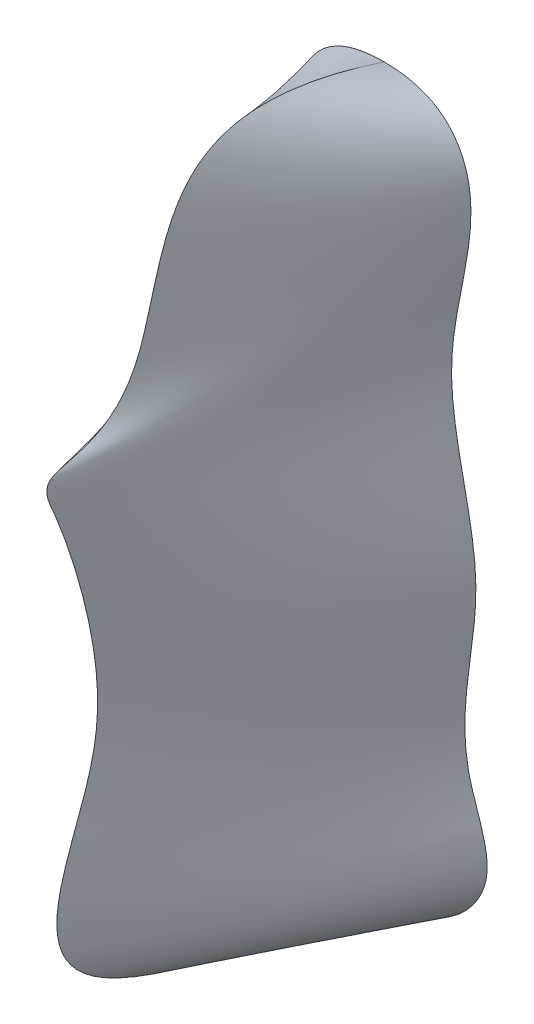
ISO-10303-21;
HEADER;
FILE_DESCRIPTION(('STEP AP214'),'2;1');
FILE_NAME('part.step','',(''),(''),'','','');
FILE_SCHEMA(('AUTOMOTIVE_DESIGN { 1 0 10303 214 1 1 1 1 }'));
ENDSEC;
DATA;
#1=APPLICATION_CONTEXT('core data for automotive mechanical design processes');
#2=APPLICATION_PROTOCOL_DEFINITION('international standard','automotive_design',2000,#1);
#3=PRODUCT_CONTEXT('',#1,'mechanical');
#4=PRODUCT('Part','Part','',(#3));
#5=PRODUCT_RELATED_PRODUCT_CATEGORY('part','',(#4));
#6=PRODUCT_DEFINITION_FORMATION('','',#4);
#7=PRODUCT_DEFINITION_CONTEXT('part definition',#1,'design');
#8=PRODUCT_DEFINITION('design','',#6,#7);
#9=PRODUCT_DEFINITION_SHAPE('','',#8);
#10=(LENGTH_UNIT() NAMED_UNIT(*) SI_UNIT(.MILLI.,.METRE.));
#11=(NAMED_UNIT(*) PLANE_ANGLE_UNIT() SI_UNIT($,.RADIAN.));
#12=(NAMED_UNIT(*) SI_UNIT($,.STERADIAN.) SOLID_ANGLE_UNIT());
#13=UNCERTAINTY_MEASURE_WITH_UNIT(LENGTH_MEASURE(1.E-05),#10,'distance_accuracy_value','');
#14=(GEOMETRIC_REPRESENTATION_CONTEXT(3) GLOBAL_UNCERTAINTY_ASSIGNED_CONTEXT((#13)) GLOBAL_UNIT_ASSIGNED_CONTEXT((#10,
#11,#12)) REPRESENTATION_CONTEXT('',''));
#15=CARTESIAN_POINT('',(0.,0.,0.));
#16=DIRECTION('',(0.,0.,1.));
#17=DIRECTION('',(1.,0.,0.));
#18=AXIS2_PLACEMENT_3D('',#15,#16,#17);
#19=CARTESIAN_POINT('',(0.,0.,0.));
#20=DIRECTION('',(0.,0.,1.));
#21=DIRECTION('',(1.,0.,0.));
#22=AXIS2_PLACEMENT_3D('',#19,#20,#21);
#23=PLANE('',#22);
#24=CARTESIAN_POINT('',(0.,-119.129235642163,0.));
#25=CARTESIAN_POINT('',(-5.48399979645558,-119.129235642163,0.));
#26=CARTESIAN_POINT('',(-13.8478622037575,-116.927261861599,0.));
#27=CARTESIAN_POINT('',(-22.1772053974844,-109.959351759126,0.));
#28=CARTESIAN_POINT('',(-25.5032366973788,-104.215245078503,0.));
#29=CARTESIAN_POINT('',(-26.3903750569086,-99.6534242154083,0.));
#30=CARTESIAN_POINT('',(-26.2585480775786,-95.8638796795702,0.));
#31=CARTESIAN_POINT('',(-25.1570675054309,-90.8407806983924,0.));
#32=CARTESIAN_POINT('',(-23.3507093255081,-85.9033015284378,0.));
#33=CARTESIAN_POINT('',(-22.2723368230284,-82.3617609658537,0.));
#34=CARTESIAN_POINT('',(-21.9316080637026,-81.0803199413565,0.));
#35=CARTESIAN_POINT('',(-21.2966625685179,-78.5825608715299,0.));
#36=CARTESIAN_POINT('',(-20.4244703114295,-72.6717924955169,0.));
#37=CARTESIAN_POINT('',(-20.6410560037412,-66.4789326386389,0.));
#38=CARTESIAN_POINT('',(-21.4728669454895,-57.5706817754429,0.));
#39=CARTESIAN_POINT('',(-22.3974310883937,-51.9503014310119,0.));
#40=CARTESIAN_POINT('',(-22.9458516318404,-46.7872022990454,0.));
#41=CARTESIAN_POINT('',(-23.1487004428223,-44.8495205048332,0.));
#42=CARTESIAN_POINT('',(-23.523959037703,-40.4426150918797,0.));
#43=CARTESIAN_POINT('',(-23.3843523134783,-33.9956772951204,0.));
#44=CARTESIAN_POINT('',(-22.0629202569013,-23.5681445082839,0.));
#45=CARTESIAN_POINT('',(-19.567261691251,-13.0780107241993,0.));
#46=CARTESIAN_POINT('',(-17.9449621263461,-3.56691671409386,0.));
#47=CARTESIAN_POINT('',(-17.372180178593,1.86551288266947,0.));
#48=CARTESIAN_POINT('',(-17.2066029441435,4.97504273164082,0.));
#49=CARTESIAN_POINT('',(-17.2309613773402,8.6765108243899,0.));
#50=CARTESIAN_POINT('',(-17.3761300157578,11.1771831859446,0.));
#51=CARTESIAN_POINT('',(-17.5810395114394,13.1536789923446,0.));
#52=CARTESIAN_POINT('',(-18.2630607748619,19.0872908589465,0.));
#53=CARTESIAN_POINT('',(-20.0706882981899,27.3589184416595,0.));
#54=CARTESIAN_POINT('',(-21.7265724819304,36.8893644465746,0.));
#55=CARTESIAN_POINT('',(-22.1166823619826,41.6254763822693,0.));
#56=CARTESIAN_POINT('',(-22.2307777149192,45.7834084200696,0.));
#57=CARTESIAN_POINT('',(-21.935413160548,49.6011848804442,0.));
#58=CARTESIAN_POINT('',(-20.7900504282564,53.7458860061697,0.));
#59=CARTESIAN_POINT('',(-19.2538935127385,57.411107423138,0.));
#60=CARTESIAN_POINT('',(-16.7723620438494,60.7450652821421,0.));
#61=CARTESIAN_POINT('',(-12.9724574464762,63.630905841916,0.));
#62=CARTESIAN_POINT('',(-7.73988467458753,65.9658932005866,0.));
#63=CARTESIAN_POINT('',(-3.00582987240848,66.4763446761754,0.));
#64=CARTESIAN_POINT('',(0.,66.4763446761754,0.));
#65=B_SPLINE_CURVE_WITH_KNOTS('',3,(#24,#25,#26,#27,#28,#29,#30,#31,#32,#33,#34,#35,#36,#37,#38,
#39,#40,#41,#42,#43,#44,#45,#46,#47,#48,#49,#50,#51,#52,#53,#54,#55,#56,#57,#58,#59,#60,#61,#62,
#63,#64),.UNSPECIFIED.,.F.,.F.,(4,1,1,1,1,1,1,1,2,1,1,1,1,1,2,1,1,1,1,1,1,1,1,1,2,1,1,1,1,1,1,1,
1,1,1,4),(0.,0.0757535775039592,0.115124491824758,0.147926686342702,0.165899705909486,
0.178786214817512,0.200138898595952,0.236696235595362,0.251306105832758,0.255014075804887,
0.286912248987947,0.33357501469864,0.34044396366016,0.410374639338128,0.412174808925913,
0.437290124185794,0.473231144814136,0.501100005431592,0.582382975594219,0.622037419765252,
0.634266738064513,0.657878408307154,0.665013128791956,0.68541085006515,0.692462696595046,
0.767929709030146,0.809294645509021,0.826014632497191,0.83353893672674,0.866729597518556,
0.878573801359312,0.89281893485578,0.921534056959989,0.935104871489121,0.958486547415341,1.),.UNSPECIFIED.);
#66=CARTESIAN_POINT('',(0.,66.4763446761752,-3.83726710373055E-13));
#67=VERTEX_POINT('',#66);
#68=CARTESIAN_POINT('',(0.,-119.129235642163,0.));
#69=VERTEX_POINT('',#68);
#70=EDGE_CURVE('E86',#67,#69,#65,.F.);
#71=ORIENTED_EDGE('',*,*,#70,.F.);
#72=CARTESIAN_POINT('',(0.,-119.129235642163,0.));
#73=CARTESIAN_POINT('',(5.48399979645558,-119.129235642163,0.));
#74=CARTESIAN_POINT('',(13.8478622037575,-116.927261861599,0.));
#75=CARTESIAN_POINT('',(22.1772053974843,-109.959351759126,0.));
#76=CARTESIAN_POINT('',(25.5032366973789,-104.215245078503,0.));
#77=CARTESIAN_POINT('',(26.3903750569087,-99.6534242154083,0.));
#78=CARTESIAN_POINT('',(26.2585480775786,-95.8638796795701,0.));
#79=CARTESIAN_POINT('',(25.157067505431,-90.8407806983927,0.));
#80=CARTESIAN_POINT('',(23.350709325508,-85.9033015284386,0.));
#81=CARTESIAN_POINT('',(22.2723368230284,-82.361760965854,0.));
#82=CARTESIAN_POINT('',(21.9316080637026,-81.0803199413565,0.));
#83=CARTESIAN_POINT('',(21.296662568518,-78.5825608715295,0.));
#84=CARTESIAN_POINT('',(20.4244703114296,-72.6717924955173,0.));
#85=CARTESIAN_POINT('',(20.6410560037411,-66.4789326386392,0.));
#86=CARTESIAN_POINT('',(21.4728669454895,-57.5706817754429,0.));
#87=CARTESIAN_POINT('',(22.3974310883937,-51.9503014310117,0.));
#88=CARTESIAN_POINT('',(22.9458516318404,-46.7872022990453,0.));
#89=CARTESIAN_POINT('',(23.1487004428223,-44.8495205048331,0.));
#90=CARTESIAN_POINT('',(23.523959037703,-40.4426150918797,0.));
#91=CARTESIAN_POINT('',(23.3843523134783,-33.9956772951204,0.));
#92=CARTESIAN_POINT('',(22.0629202569013,-23.5681445082838,0.));
#93=CARTESIAN_POINT('',(19.5672616912507,-13.0780107241991,0.));
#94=CARTESIAN_POINT('',(17.944962126346,-3.56691671409373,0.));
#95=CARTESIAN_POINT('',(17.3721801785931,1.86551288266953,0.));
#96=CARTESIAN_POINT('',(17.2066029441435,4.97504273164088,0.));
#97=CARTESIAN_POINT('',(17.2309613773402,8.67651082438992,0.));
#98=CARTESIAN_POINT('',(17.3761300157577,11.1771831859446,0.));
#99=CARTESIAN_POINT('',(17.5810395114394,13.1536789923447,0.));
#100=CARTESIAN_POINT('',(18.2630607748619,19.0872908589466,0.));
#101=CARTESIAN_POINT('',(20.0706882981898,27.3589184416596,0.));
#102=CARTESIAN_POINT('',(21.7265724819305,36.8893644465748,0.));
#103=CARTESIAN_POINT('',(22.1166823619826,41.6254763822692,0.));
#104=CARTESIAN_POINT('',(22.2307777149191,45.7834084200695,0.));
#105=CARTESIAN_POINT('',(21.935413160548,49.6011848804442,0.));
#106=CARTESIAN_POINT('',(20.7900504282564,53.7458860061697,0.));
#107=CARTESIAN_POINT('',(19.2538935127385,57.4111074231379,0.));
#108=CARTESIAN_POINT('',(16.7723620438494,60.7450652821421,0.));
#109=CARTESIAN_POINT('',(12.9724574464762,63.630905841916,0.));
#110=CARTESIAN_POINT('',(7.73988467458753,65.9658932005866,0.));
#111=CARTESIAN_POINT('',(3.00582987240848,66.4763446761754,0.));
#112=CARTESIAN_POINT('',(0.,66.4763446761754,0.));
#113=B_SPLINE_CURVE_WITH_KNOTS('',3,(#72,#73,#74,#75,#76,#77,#78,#79,#80,#81,#82,#83,#84,#85,
#86,#87,#88,#89,#90,#91,#92,#93,#94,#95,#96,#97,#98,#99,#100,#101,#102,#103,#104,#105,#106,#107,
#108,#109,#110,#111,#112),.UNSPECIFIED.,.F.,.F.,(4,1,1,1,1,1,1,1,2,1,1,1,1,1,2,1,1,1,1,1,1,1,1,
1,2,1,1,1,1,1,1,1,1,1,1,4),(0.,0.0757535775039592,0.115124491824758,0.147926686342702,
0.165899705909486,0.178786214817512,0.200138898595952,0.236696235595362,0.251306105832758,
0.255014075804887,0.286912248987947,0.33357501469864,0.34044396366016,0.410374639338128,
0.412174808925913,0.437290124185794,0.473231144814136,0.501100005431592,0.582382975594219,
0.622037419765252,0.634266738064513,0.657878408307154,0.665013128791956,0.68541085006515,
0.692462696595046,0.767929709030146,0.809294645509021,0.826014632497191,0.83353893672674,
0.866729597518556,0.878573801359312,0.89281893485578,0.921534056959989,0.935104871489121,
0.958486547415341,1.),.UNSPECIFIED.);
#114=EDGE_CURVE('E13',#69,#67,#113,.T.);
#115=ORIENTED_EDGE('',*,*,#114,.F.);
#116=EDGE_LOOP('',(#71,#115));
#117=FACE_BOUND('',#116,.T.);
#118=ADVANCED_FACE('F67',(#117),#23,.F.);
#119=CARTESIAN_POINT('',(0.,-119.129235642163,0.));
#120=CARTESIAN_POINT('',(0.,-119.129235642163,0.));
#121=CARTESIAN_POINT('',(0.,-115.684729267578,18.653499300207));
#122=CARTESIAN_POINT('',(-5.48399979645558,-119.129235642163,0.));
#123=CARTESIAN_POINT('',(0.,-111.09722014926,41.7852148196173));
#124=CARTESIAN_POINT('',(-13.8478622037575,-116.927261861599,0.));
#125=CARTESIAN_POINT('',(0.,-104.861834882826,62.2161484048368));
#126=CARTESIAN_POINT('',(-22.1772053974844,-109.959351759126,0.));
#127=CARTESIAN_POINT('',(0.,-100.613229648355,71.2945689341411));
#128=CARTESIAN_POINT('',(-25.5032366973788,-104.215245078503,0.));
#129=CARTESIAN_POINT('',(0.,-97.2579962258294,76.1039582080557));
#130=CARTESIAN_POINT('',(-26.3903750569086,-99.6534242154083,0.));
#131=CARTESIAN_POINT('',(0.,-94.2933052290315,79.2700088025345));
#132=CARTESIAN_POINT('',(-26.2585480775786,-95.8638796795702,0.));
#133=CARTESIAN_POINT('',(0.,-89.914230995515,82.4136260831746));
#134=CARTESIAN_POINT('',(-25.1570675054309,-90.8407806983924,0.));
#135=CARTESIAN_POINT('',(0.,-84.6948198773536,83.704694672683));
#136=CARTESIAN_POINT('',(-23.3507093255081,-85.9033015284378,0.));
#137=CARTESIAN_POINT('',(0.,-80.435747161199,83.4793985463131));
#138=CARTESIAN_POINT('',(-22.2723368230284,-82.3617609658537,0.));
#139=CARTESIAN_POINT('',(0.,-78.8548052590881,83.2854059539554));
#140=CARTESIAN_POINT('',(-21.9316080637026,-81.0803199413565,0.));
#141=CARTESIAN_POINT('',(0.,-75.7540536988175,82.8524111803916));
#142=CARTESIAN_POINT('',(-21.2966625685179,-78.5825608715299,0.));
#143=CARTESIAN_POINT('',(0.,-67.9821779391295,80.6192283715563));
#144=CARTESIAN_POINT('',(-20.4244703114295,-72.6717924955169,0.));
#145=CARTESIAN_POINT('',(0.,-59.6646763353723,77.2442058603551));
#146=CARTESIAN_POINT('',(-20.6410560037412,-66.4789326386389,0.));
#147=CARTESIAN_POINT('',(0.,-49.0503592895246,73.8741721166368));
#148=CARTESIAN_POINT('',(-21.4728669454895,-57.5706817754429,0.));
#149=CARTESIAN_POINT('',(0.,-43.4091086797953,73.0663969821838));
#150=CARTESIAN_POINT('',(-22.3974310883937,-51.9503014310119,0.));
#151=CARTESIAN_POINT('',(0.,-37.7537294011581,73.1293274319195));
#152=CARTESIAN_POINT('',(-22.9458516318404,-46.7872022990454,0.));
#153=CARTESIAN_POINT('',(0.,-35.6270397565945,73.1603831301112));
#154=CARTESIAN_POINT('',(-23.1487004428223,-44.8495205048332,0.));
#155=CARTESIAN_POINT('',(0.,-30.6562886472405,73.4663716847879));
#156=CARTESIAN_POINT('',(-23.523959037703,-40.4426150918797,0.));
#157=CARTESIAN_POINT('',(0.,-23.1286645891634,74.6019580328208));
#158=CARTESIAN_POINT('',(-23.3843523134783,-33.9956772951204,0.));
#159=CARTESIAN_POINT('',(0.,-10.9180065251462,77.27979758046));
#160=CARTESIAN_POINT('',(-22.0629202569013,-23.5681445082839,0.));
#161=CARTESIAN_POINT('',(0.,0.714013766306203,80.9953412643995));
#162=CARTESIAN_POINT('',(-19.567261691251,-13.0780107241993,0.));
#163=CARTESIAN_POINT('',(0.,8.02617014812814,83.89857119465));
#164=CARTESIAN_POINT('',(-17.9449621263461,-3.56691671409386,0.));
#165=CARTESIAN_POINT('',(0.,11.1556070664767,85.2778175725474));
#166=CARTESIAN_POINT('',(-17.372180178593,1.86551288266947,0.));
#167=CARTESIAN_POINT('',(0.,12.6582471725762,85.8609462171586));
#168=CARTESIAN_POINT('',(-17.2066029441435,4.97504273164082,0.));
#169=CARTESIAN_POINT('',(0.,14.3998620359732,86.1571977129723));
#170=CARTESIAN_POINT('',(-17.2309613773402,8.6765108243899,0.));
#171=CARTESIAN_POINT('',(0.,15.5928712678497,86.0816649037519));
#172=CARTESIAN_POINT('',(-17.3761300157578,11.1771831859446,0.));
#173=CARTESIAN_POINT('',(0.,16.2715369348896,85.5715281646994));
#174=CARTESIAN_POINT('',(-17.5810395114394,13.1536789923446,0.));
#175=CARTESIAN_POINT('',(0.,18.1426667496547,83.7180392875684));
#176=CARTESIAN_POINT('',(-18.2630607748619,19.0872908589465,0.));
#177=CARTESIAN_POINT('',(0.,18.2300835563813,76.2465380409917));
#178=CARTESIAN_POINT('',(-20.0706882981899,27.3589184416595,0.));
#179=CARTESIAN_POINT('',(0.,24.7227058163408,67.0939442195577));
#180=CARTESIAN_POINT('',(-21.7265724819304,36.8893644465746,0.));
#181=CARTESIAN_POINT('',(0.,30.9363641447266,63.5146395751189));
#182=CARTESIAN_POINT('',(-22.1166823619826,41.6254763822693,0.));
#183=CARTESIAN_POINT('',(0.,37.6968605332303,60.8738672061137));
#184=CARTESIAN_POINT('',(-22.2307777149192,45.7834084200696,0.));
#185=CARTESIAN_POINT('',(0.,45.4780601721517,59.0007353969081));
#186=CARTESIAN_POINT('',(-21.935413160548,49.6011848804442,0.));
#187=CARTESIAN_POINT('',(0.,53.847061296212,56.3909198600287));
#188=CARTESIAN_POINT('',(-20.7900504282564,53.7458860061697,0.));
#189=CARTESIAN_POINT('',(0.,60.9081003940844,53.4872740191013));
#190=CARTESIAN_POINT('',(-19.2538935127385,57.411107423138,0.));
#191=CARTESIAN_POINT('',(0.,66.7448995063504,49.1995744265794));
#192=CARTESIAN_POINT('',(-16.7723620438494,60.7450652821421,0.));
#193=CARTESIAN_POINT('',(0.,71.1834059991768,41.6834897247874));
#194=CARTESIAN_POINT('',(-12.9724574464762,63.630905841916,0.));
#195=CARTESIAN_POINT('',(0.,73.7025856986463,29.5332596215666));
#196=CARTESIAN_POINT('',(-7.73988467458753,65.9658932005866,0.));
#197=CARTESIAN_POINT('',(0.,70.8929110556788,13.5752804493367));
#198=CARTESIAN_POINT('',(-3.00582987240848,66.4763446761754,0.));
#199=CARTESIAN_POINT('',(0.,66.4763446761751,-7.67453420746109E-13));
#200=CARTESIAN_POINT('',(0.,66.4763446761754,0.));
#201=B_SPLINE_SURFACE_WITH_KNOTS('',3,1,((#119,#120),(#121,#122),(#123,#124),(#125,#126),(#127,
#128),(#129,#130),(#131,#132),(#133,#134),(#135,#136),(#137,#138),(#139,#140),(#141,#142),(#143,
#144),(#145,#146),(#147,#148),(#149,#150),(#151,#152),(#153,#154),(#155,#156),(#157,#158),(#159,
#160),(#161,#162),(#163,#164),(#165,#166),(#167,#168),(#169,#170),(#171,#172),(#173,#174),(#175,
#176),(#177,#178),(#179,#180),(#181,#182),(#183,#184),(#185,#186),(#187,#188),(#189,#190),(#191,
#192),(#193,#194),(#195,#196),(#197,#198),(#199,#200)),.UNSPECIFIED.,.F.,.F.,.F.,(4,1,1,1,1,1,1,
1,2,1,1,1,1,1,2,1,1,1,1,1,1,1,1,1,2,1,1,1,1,1,1,1,1,1,1,4),(2,2),(0.,0.0757535775039592,
0.115124491824758,0.147926686342702,0.165899705909486,0.178786214817512,0.200138898595952,
0.236696235595362,0.251306105832758,0.255014075804887,0.286912248987947,0.33357501469864,
0.34044396366016,0.410374639338128,0.412174808925913,0.437290124185794,0.473231144814136,
0.501100005431592,0.582382975594219,0.622037419765252,0.634266738064513,0.657878408307154,
0.665013128791956,0.68541085006515,0.692462696595046,0.767929709030146,0.809294645509021,
0.826014632497191,0.83353893672674,0.866729597518556,0.878573801359312,0.89281893485578,
0.921534056959989,0.935104871489121,0.958486547415341,1.),(0.,1.),.UNSPECIFIED.);
#202=CARTESIAN_POINT('',(0.,-119.129235642163,0.));
#203=CARTESIAN_POINT('',(0.,-115.684729267578,18.653499300207));
#204=CARTESIAN_POINT('',(0.,-111.09722014926,41.7852148196173));
#205=CARTESIAN_POINT('',(0.,-104.861834882826,62.2161484048368));
#206=CARTESIAN_POINT('',(0.,-100.613229648355,71.2945689341411));
#207=CARTESIAN_POINT('',(0.,-97.2579962258294,76.1039582080557));
#208=CARTESIAN_POINT('',(0.,-94.2933052290315,79.2700088025345));
#209=CARTESIAN_POINT('',(0.,-89.914230995515,82.4136260831746));
#210=CARTESIAN_POINT('',(0.,-84.6948198773536,83.704694672683));
#211=CARTESIAN_POINT('',(0.,-80.435747161199,83.4793985463131));
#212=CARTESIAN_POINT('',(0.,-78.8548052590881,83.2854059539554));
#213=CARTESIAN_POINT('',(0.,-75.7540536988175,82.8524111803916));
#214=CARTESIAN_POINT('',(0.,-67.9821779391295,80.6192283715563));
#215=CARTESIAN_POINT('',(0.,-59.6646763353723,77.2442058603551));
#216=CARTESIAN_POINT('',(0.,-49.0503592895246,73.8741721166368));
#217=CARTESIAN_POINT('',(0.,-43.4091086797953,73.0663969821838));
#218=CARTESIAN_POINT('',(0.,-37.7537294011581,73.1293274319195));
#219=CARTESIAN_POINT('',(0.,-35.6270397565945,73.1603831301112));
#220=CARTESIAN_POINT('',(0.,-30.6562886472405,73.4663716847879));
#221=CARTESIAN_POINT('',(0.,-23.1286645891634,74.6019580328208));
#222=CARTESIAN_POINT('',(0.,-10.9180065251462,77.27979758046));
#223=CARTESIAN_POINT('',(0.,0.714013766306203,80.9953412643995));
#224=CARTESIAN_POINT('',(0.,8.02617014812814,83.89857119465));
#225=CARTESIAN_POINT('',(0.,11.1556070664767,85.2778175725474));
#226=CARTESIAN_POINT('',(0.,12.6582471725762,85.8609462171586));
#227=CARTESIAN_POINT('',(0.,14.3998620359732,86.1571977129723));
#228=CARTESIAN_POINT('',(0.,15.5928712678497,86.0816649037519));
#229=CARTESIAN_POINT('',(0.,16.2715369348896,85.5715281646994));
#230=CARTESIAN_POINT('',(0.,18.1426667496547,83.7180392875684));
#231=CARTESIAN_POINT('',(0.,18.2300835563813,76.2465380409917));
#232=CARTESIAN_POINT('',(0.,24.7227058163408,67.0939442195577));
#233=CARTESIAN_POINT('',(0.,30.9363641447266,63.5146395751189));
#234=CARTESIAN_POINT('',(0.,37.6968605332303,60.8738672061137));
#235=CARTESIAN_POINT('',(0.,45.4780601721517,59.0007353969081));
#236=CARTESIAN_POINT('',(0.,53.847061296212,56.3909198600287));
#237=CARTESIAN_POINT('',(0.,60.9081003940844,53.4872740191013));
#238=CARTESIAN_POINT('',(0.,66.7448995063504,49.1995744265794));
#239=CARTESIAN_POINT('',(0.,71.1834059991768,41.6834897247874));
#240=CARTESIAN_POINT('',(0.,73.7025856986463,29.5332596215666));
#241=CARTESIAN_POINT('',(0.,70.8929110556788,13.5752804493367));
#242=CARTESIAN_POINT('',(0.,66.4763446761751,-7.67453420746109E-13));
#243=B_SPLINE_CURVE_WITH_KNOTS('',3,(#202,#203,#204,#205,#206,#207,#208,#209,#210,#211,#212,
#213,#214,#215,#216,#217,#218,#219,#220,#221,#222,#223,#224,#225,#226,#227,#228,#229,#230,#231,
#232,#233,#234,#235,#236,#237,#238,#239,#240,#241,#242),.UNSPECIFIED.,.F.,.F.,(4,1,1,1,1,1,1,1,
2,1,1,1,1,1,2,1,1,1,1,1,1,1,1,1,2,1,1,1,1,1,1,1,1,1,1,4),(0.,0.0757535775039592,
0.115124491824758,0.147926686342702,0.165899705909486,0.178786214817512,0.200138898595952,
0.236696235595362,0.251306105832758,0.255014075804887,0.286912248987947,0.33357501469864,
0.34044396366016,0.410374639338128,0.412174808925913,0.437290124185794,0.473231144814136,
0.501100005431592,0.582382975594219,0.622037419765252,0.634266738064513,0.657878408307154,
0.665013128791956,0.68541085006515,0.692462696595046,0.767929709030146,0.809294645509021,
0.826014632497191,0.83353893672674,0.866729597518556,0.878573801359312,0.89281893485578,
0.921534056959989,0.935104871489121,0.958486547415341,1.),.UNSPECIFIED.);
#244=EDGE_CURVE('E77',#67,#69,#243,.F.);
#245=ORIENTED_EDGE('',*,*,#244,.F.);
#246=ORIENTED_EDGE('',*,*,#70,.T.);
#247=EDGE_LOOP('',(#245,#246));
#248=FACE_BOUND('',#247,.T.);
#249=ADVANCED_FACE('F88',(#248),#201,.T.);
#250=CARTESIAN_POINT('',(0.,-119.129235642163,0.));
#251=CARTESIAN_POINT('',(0.,-119.129235642163,0.));
#252=CARTESIAN_POINT('',(5.48399979645558,-119.129235642163,0.));
#253=CARTESIAN_POINT('',(0.,-115.684729267578,18.653499300207));
#254=CARTESIAN_POINT('',(13.8478622037575,-116.927261861599,0.));
#255=CARTESIAN_POINT('',(0.,-111.09722014926,41.7852148196173));
#256=CARTESIAN_POINT('',(22.1772053974843,-109.959351759126,0.));
#257=CARTESIAN_POINT('',(0.,-104.861834882826,62.2161484048368));
#258=CARTESIAN_POINT('',(25.5032366973789,-104.215245078503,0.));
#259=CARTESIAN_POINT('',(0.,-100.613229648355,71.2945689341411));
#260=CARTESIAN_POINT('',(26.3903750569087,-99.6534242154083,0.));
#261=CARTESIAN_POINT('',(0.,-97.2579962258294,76.1039582080557));
#262=CARTESIAN_POINT('',(26.2585480775786,-95.8638796795701,0.));
#263=CARTESIAN_POINT('',(0.,-94.2933052290315,79.2700088025345));
#264=CARTESIAN_POINT('',(25.157067505431,-90.8407806983927,0.));
#265=CARTESIAN_POINT('',(0.,-89.914230995515,82.4136260831746));
#266=CARTESIAN_POINT('',(23.350709325508,-85.9033015284386,0.));
#267=CARTESIAN_POINT('',(0.,-84.6948198773536,83.704694672683));
#268=CARTESIAN_POINT('',(22.2723368230284,-82.361760965854,0.));
#269=CARTESIAN_POINT('',(0.,-80.435747161199,83.4793985463131));
#270=CARTESIAN_POINT('',(21.9316080637026,-81.0803199413565,0.));
#271=CARTESIAN_POINT('',(0.,-78.8548052590881,83.2854059539554));
#272=CARTESIAN_POINT('',(21.296662568518,-78.5825608715295,0.));
#273=CARTESIAN_POINT('',(0.,-75.7540536988175,82.8524111803916));
#274=CARTESIAN_POINT('',(20.4244703114296,-72.6717924955173,0.));
#275=CARTESIAN_POINT('',(0.,-67.9821779391295,80.6192283715563));
#276=CARTESIAN_POINT('',(20.6410560037411,-66.4789326386392,0.));
#277=CARTESIAN_POINT('',(0.,-59.6646763353723,77.2442058603551));
#278=CARTESIAN_POINT('',(21.4728669454895,-57.5706817754429,0.));
#279=CARTESIAN_POINT('',(0.,-49.0503592895246,73.8741721166368));
#280=CARTESIAN_POINT('',(22.3974310883937,-51.9503014310117,0.));
#281=CARTESIAN_POINT('',(0.,-43.4091086797953,73.0663969821838));
#282=CARTESIAN_POINT('',(22.9458516318404,-46.7872022990453,0.));
#283=CARTESIAN_POINT('',(0.,-37.7537294011581,73.1293274319195));
#284=CARTESIAN_POINT('',(23.1487004428223,-44.8495205048331,0.));
#285=CARTESIAN_POINT('',(0.,-35.6270397565945,73.1603831301112));
#286=CARTESIAN_POINT('',(23.523959037703,-40.4426150918797,0.));
#287=CARTESIAN_POINT('',(0.,-30.6562886472405,73.4663716847879));
#288=CARTESIAN_POINT('',(23.3843523134783,-33.9956772951204,0.));
#289=CARTESIAN_POINT('',(0.,-23.1286645891634,74.6019580328208));
#290=CARTESIAN_POINT('',(22.0629202569013,-23.5681445082838,0.));
#291=CARTESIAN_POINT('',(0.,-10.9180065251462,77.27979758046));
#292=CARTESIAN_POINT('',(19.5672616912507,-13.0780107241991,0.));
#293=CARTESIAN_POINT('',(0.,0.714013766306203,80.9953412643995));
#294=CARTESIAN_POINT('',(17.944962126346,-3.56691671409373,0.));
#295=CARTESIAN_POINT('',(0.,8.02617014812814,83.89857119465));
#296=CARTESIAN_POINT('',(17.3721801785931,1.86551288266953,0.));
#297=CARTESIAN_POINT('',(0.,11.1556070664767,85.2778175725474));
#298=CARTESIAN_POINT('',(17.2066029441435,4.97504273164088,0.));
#299=CARTESIAN_POINT('',(0.,12.6582471725762,85.8609462171586));
#300=CARTESIAN_POINT('',(17.2309613773402,8.67651082438992,0.));
#301=CARTESIAN_POINT('',(0.,14.3998620359732,86.1571977129723));
#302=CARTESIAN_POINT('',(17.3761300157577,11.1771831859446,0.));
#303=CARTESIAN_POINT('',(0.,15.5928712678497,86.0816649037519));
#304=CARTESIAN_POINT('',(17.5810395114394,13.1536789923447,0.));
#305=CARTESIAN_POINT('',(0.,16.2715369348896,85.5715281646994));
#306=CARTESIAN_POINT('',(18.2630607748619,19.0872908589466,0.));
#307=CARTESIAN_POINT('',(0.,18.1426667496547,83.7180392875684));
#308=CARTESIAN_POINT('',(20.0706882981898,27.3589184416596,0.));
#309=CARTESIAN_POINT('',(0.,18.2300835563813,76.2465380409917));
#310=CARTESIAN_POINT('',(21.7265724819305,36.8893644465748,0.));
#311=CARTESIAN_POINT('',(0.,24.7227058163408,67.0939442195577));
#312=CARTESIAN_POINT('',(22.1166823619826,41.6254763822692,0.));
#313=CARTESIAN_POINT('',(0.,30.9363641447266,63.5146395751189));
#314=CARTESIAN_POINT('',(22.2307777149191,45.7834084200695,0.));
#315=CARTESIAN_POINT('',(0.,37.6968605332303,60.8738672061137));
#316=CARTESIAN_POINT('',(21.935413160548,49.6011848804442,0.));
#317=CARTESIAN_POINT('',(0.,45.4780601721517,59.0007353969081));
#318=CARTESIAN_POINT('',(20.7900504282564,53.7458860061697,0.));
#319=CARTESIAN_POINT('',(0.,53.847061296212,56.3909198600287));
#320=CARTESIAN_POINT('',(19.2538935127385,57.4111074231379,0.));
#321=CARTESIAN_POINT('',(0.,60.9081003940844,53.4872740191013));
#322=CARTESIAN_POINT('',(16.7723620438494,60.7450652821421,0.));
#323=CARTESIAN_POINT('',(0.,66.7448995063504,49.1995744265794));
#324=CARTESIAN_POINT('',(12.9724574464762,63.630905841916,0.));
#325=CARTESIAN_POINT('',(0.,71.1834059991768,41.6834897247874));
#326=CARTESIAN_POINT('',(7.73988467458753,65.9658932005866,0.));
#327=CARTESIAN_POINT('',(0.,73.7025856986463,29.5332596215666));
#328=CARTESIAN_POINT('',(3.00582987240848,66.4763446761754,0.));
#329=CARTESIAN_POINT('',(0.,70.8929110556788,13.5752804493367));
#330=CARTESIAN_POINT('',(0.,66.4763446761754,0.));
#331=CARTESIAN_POINT('',(0.,66.4763446761751,-7.67453420746109E-13));
#332=B_SPLINE_SURFACE_WITH_KNOTS('',3,1,((#250,#251),(#252,#253),(#254,#255),(#256,#257),(#258,
#259),(#260,#261),(#262,#263),(#264,#265),(#266,#267),(#268,#269),(#270,#271),(#272,#273),(#274,
#275),(#276,#277),(#278,#279),(#280,#281),(#282,#283),(#284,#285),(#286,#287),(#288,#289),(#290,
#291),(#292,#293),(#294,#295),(#296,#297),(#298,#299),(#300,#301),(#302,#303),(#304,#305),(#306,
#307),(#308,#309),(#310,#311),(#312,#313),(#314,#315),(#316,#317),(#318,#319),(#320,#321),(#322,
#323),(#324,#325),(#326,#327),(#328,#329),(#330,#331)),.UNSPECIFIED.,.F.,.F.,.F.,(4,1,1,1,1,1,1,
1,2,1,1,1,1,1,2,1,1,1,1,1,1,1,1,1,2,1,1,1,1,1,1,1,1,1,1,4),(2,2),(0.,0.0757535775039592,
0.115124491824758,0.147926686342702,0.165899705909486,0.178786214817512,0.200138898595952,
0.236696235595362,0.251306105832758,0.255014075804887,0.286912248987947,0.33357501469864,
0.34044396366016,0.410374639338128,0.412174808925913,0.437290124185794,0.473231144814136,
0.501100005431592,0.582382975594219,0.622037419765252,0.634266738064513,0.657878408307154,
0.665013128791956,0.68541085006515,0.692462696595046,0.767929709030146,0.809294645509021,
0.826014632497191,0.83353893672674,0.866729597518556,0.878573801359312,0.89281893485578,
0.921534056959989,0.935104871489121,0.958486547415341,1.),(0.,1.),.UNSPECIFIED.);
#333=ORIENTED_EDGE('',*,*,#114,.T.);
#334=ORIENTED_EDGE('',*,*,#244,.T.);
#335=EDGE_LOOP('',(#333,#334));
#336=FACE_BOUND('',#335,.T.);
#337=ADVANCED_FACE('F90',(#336),#332,.T.);
#338=CLOSED_SHELL('',(#118,#249,#337));
#339=MANIFOLD_SOLID_BREP('B2',#338);
#340=ADVANCED_BREP_SHAPE_REPRESENTATION('',(#18,#339),#14);
#341=SHAPE_DEFINITION_REPRESENTATION(#9,#340);
ENDSEC;
END-ISO-10303-21;
